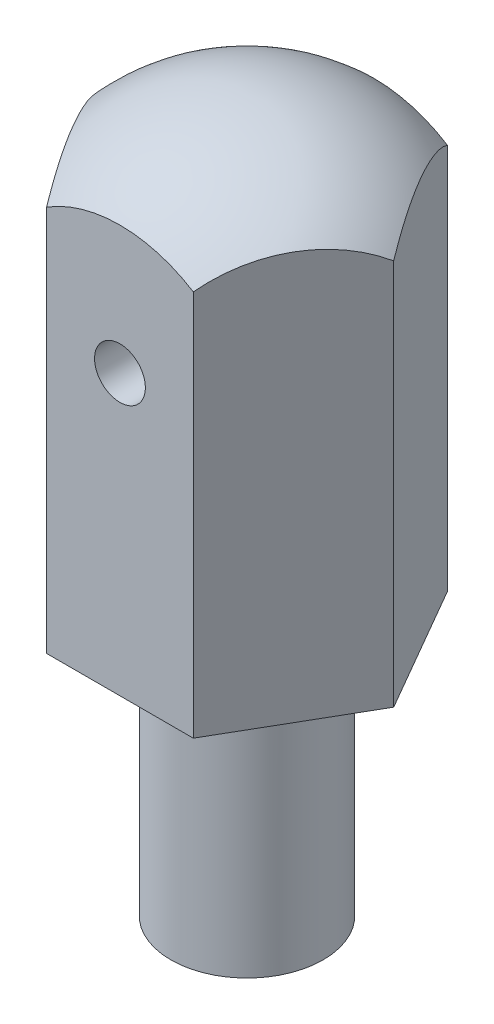
ISO-10303-21;
HEADER;
FILE_DESCRIPTION(('STEP AP214'),'2;1');
FILE_NAME('part.step','',(''),(''),'','','');
FILE_SCHEMA(('AUTOMOTIVE_DESIGN { 1 0 10303 214 1 1 1 1 }'));
ENDSEC;
DATA;
#1=APPLICATION_CONTEXT('core data for automotive mechanical design processes');
#2=APPLICATION_PROTOCOL_DEFINITION('international standard','automotive_design',2000,#1);
#3=PRODUCT_CONTEXT('',#1,'mechanical');
#4=PRODUCT('Part','Part','',(#3));
#5=PRODUCT_RELATED_PRODUCT_CATEGORY('part','',(#4));
#6=PRODUCT_DEFINITION_FORMATION('','',#4);
#7=PRODUCT_DEFINITION_CONTEXT('part definition',#1,'design');
#8=PRODUCT_DEFINITION('design','',#6,#7);
#9=PRODUCT_DEFINITION_SHAPE('','',#8);
#10=(LENGTH_UNIT() NAMED_UNIT(*) SI_UNIT(.MILLI.,.METRE.));
#11=(NAMED_UNIT(*) PLANE_ANGLE_UNIT() SI_UNIT($,.RADIAN.));
#12=(NAMED_UNIT(*) SI_UNIT($,.STERADIAN.) SOLID_ANGLE_UNIT());
#13=UNCERTAINTY_MEASURE_WITH_UNIT(LENGTH_MEASURE(1.E-05),#10,'distance_accuracy_value','');
#14=(GEOMETRIC_REPRESENTATION_CONTEXT(3) GLOBAL_UNCERTAINTY_ASSIGNED_CONTEXT((#13)) GLOBAL_UNIT_ASSIGNED_CONTEXT((#10,
#11,#12)) REPRESENTATION_CONTEXT('',''));
#15=CARTESIAN_POINT('',(0.,0.,0.));
#16=DIRECTION('',(0.,0.,1.));
#17=DIRECTION('',(1.,0.,0.));
#18=AXIS2_PLACEMENT_3D('',#15,#16,#17);
#19=CARTESIAN_POINT('',(2.88675134594812,0.,0.));
#20=DIRECTION('',(0.,1.,0.));
#21=DIRECTION('',(0.,0.,1.));
#22=AXIS2_PLACEMENT_3D('',#19,#20,#21);
#23=PLANE('',#22);
#24=DIRECTION('',(0.5,0.,-0.866025403784439));
#25=VECTOR('',#24,1.);
#26=CARTESIAN_POINT('',(1.44337567297405,0.,2.5));
#27=LINE('',#26,#25);
#28=CARTESIAN_POINT('',(1.44337567297405,0.,2.5));
#29=VERTEX_POINT('',#28);
#30=CARTESIAN_POINT('',(2.88675134594812,0.,0.));
#31=VERTEX_POINT('',#30);
#32=EDGE_CURVE('E77',#29,#31,#27,.T.);
#33=ORIENTED_EDGE('',*,*,#32,.F.);
#34=DIRECTION('',(1.,0.,0.));
#35=VECTOR('',#34,1.);
#36=CARTESIAN_POINT('',(-1.44337567297407,0.,2.5));
#37=LINE('',#36,#35);
#38=CARTESIAN_POINT('',(-1.44337567297407,0.,2.5));
#39=VERTEX_POINT('',#38);
#40=EDGE_CURVE('E99',#39,#29,#37,.T.);
#41=ORIENTED_EDGE('',*,*,#40,.F.);
#42=DIRECTION('',(0.5,0.,0.866025403784438));
#43=VECTOR('',#42,1.);
#44=CARTESIAN_POINT('',(-2.88675134594815,0.,0.));
#45=LINE('',#44,#43);
#46=CARTESIAN_POINT('',(-2.88675134594815,0.,0.));
#47=VERTEX_POINT('',#46);
#48=EDGE_CURVE('E101',#47,#39,#45,.T.);
#49=ORIENTED_EDGE('',*,*,#48,.F.);
#50=DIRECTION('',(-0.5,0.,0.866025403784438));
#51=VECTOR('',#50,1.);
#52=CARTESIAN_POINT('',(-1.44337567297407,0.,-2.5));
#53=LINE('',#52,#51);
#54=CARTESIAN_POINT('',(-1.44337567297407,0.,-2.5));
#55=VERTEX_POINT('',#54);
#56=EDGE_CURVE('E104',#55,#47,#53,.T.);
#57=ORIENTED_EDGE('',*,*,#56,.F.);
#58=DIRECTION('',(-1.,0.,0.));
#59=VECTOR('',#58,1.);
#60=CARTESIAN_POINT('',(1.44337567297404,0.,-2.5));
#61=LINE('',#60,#59);
#62=CARTESIAN_POINT('',(1.44337567297404,0.,-2.5));
#63=VERTEX_POINT('',#62);
#64=EDGE_CURVE('E107',#63,#55,#61,.T.);
#65=ORIENTED_EDGE('',*,*,#64,.F.);
#66=DIRECTION('',(-0.5,0.,-0.866025403784439));
#67=VECTOR('',#66,1.);
#68=CARTESIAN_POINT('',(2.88675134594812,0.,0.));
#69=LINE('',#68,#67);
#70=EDGE_CURVE('E110',#31,#63,#69,.T.);
#71=ORIENTED_EDGE('',*,*,#70,.F.);
#72=EDGE_LOOP('',(#33,#41,#49,#57,#65,#71));
#73=FACE_BOUND('',#72,.T.);
#74=CARTESIAN_POINT('',(0.,0.,0.));
#75=DIRECTION('',(0.,1.,0.));
#76=DIRECTION('',(0.,0.,1.));
#77=AXIS2_PLACEMENT_3D('',#74,#75,#76);
#78=CIRCLE('',#77,1.5);
#79=CARTESIAN_POINT('',(0.,0.,1.5));
#80=VERTEX_POINT('',#79);
#81=EDGE_CURVE('E11',#80,#80,#78,.F.);
#82=ORIENTED_EDGE('',*,*,#81,.F.);
#83=EDGE_LOOP('',(#82));
#84=FACE_BOUND('',#83,.T.);
#85=ADVANCED_FACE('F16',(#73,#84),#23,.F.);
#86=CARTESIAN_POINT('',(1.44337567297405,9.,2.5));
#87=DIRECTION('',(-0.866025403784439,0.,-0.5));
#88=DIRECTION('',(-0.5,0.,0.86602540378444));
#89=AXIS2_PLACEMENT_3D('',#86,#87,#88);
#90=PLANE('',#89);
#91=DIRECTION('',(0.,-1.,0.));
#92=VECTOR('',#91,1.);
#93=CARTESIAN_POINT('',(2.88675134594812,9.,0.));
#94=LINE('',#93,#92);
#95=CARTESIAN_POINT('',(2.88675134594812,7.60604160964115,0.));
#96=VERTEX_POINT('',#95);
#97=EDGE_CURVE('E83',#96,#31,#94,.T.);
#98=ORIENTED_EDGE('',*,*,#97,.F.);
#99=CARTESIAN_POINT('',(2.1650635094611,5.31393110495224,1.25));
#100=DIRECTION('',(-0.866025403784439,0.,-0.5));
#101=DIRECTION('',(-0.5,0.,0.86602540378444));
#102=AXIS2_PLACEMENT_3D('',#99,#100,#101);
#103=CIRCLE('',#102,2.70870889891081);
#104=CARTESIAN_POINT('',(1.44337567297402,7.60604160964115,2.5));
#105=VERTEX_POINT('',#104);
#106=EDGE_CURVE('E71',#96,#105,#103,.F.);
#107=ORIENTED_EDGE('',*,*,#106,.T.);
#108=DIRECTION('',(0.,-1.,0.));
#109=VECTOR('',#108,1.);
#110=CARTESIAN_POINT('',(1.44337567297405,9.,2.5));
#111=LINE('',#110,#109);
#112=EDGE_CURVE('E39',#105,#29,#111,.T.);
#113=ORIENTED_EDGE('',*,*,#112,.T.);
#114=ORIENTED_EDGE('',*,*,#32,.T.);
#115=EDGE_LOOP('',(#98,#107,#113,#114));
#116=FACE_BOUND('',#115,.T.);
#117=ADVANCED_FACE('F18',(#116),#90,.F.);
#118=CARTESIAN_POINT('',(2.88675134594812,9.,0.));
#119=DIRECTION('',(-0.866025403784439,0.,0.5));
#120=DIRECTION('',(0.5,0.,0.866025403784439));
#121=AXIS2_PLACEMENT_3D('',#118,#119,#120);
#122=PLANE('',#121);
#123=DIRECTION('',(0.,-1.,0.));
#124=VECTOR('',#123,1.);
#125=CARTESIAN_POINT('',(1.44337567297404,9.,-2.5));
#126=LINE('',#125,#124);
#127=CARTESIAN_POINT('',(1.44337567297401,7.60604160964115,-2.5));
#128=VERTEX_POINT('',#127);
#129=EDGE_CURVE('E85',#128,#63,#126,.T.);
#130=ORIENTED_EDGE('',*,*,#129,.F.);
#131=CARTESIAN_POINT('',(2.16506350946109,5.31393110495224,-1.25));
#132=DIRECTION('',(-0.866025403784439,0.,0.5));
#133=DIRECTION('',(0.5,0.,0.866025403784439));
#134=AXIS2_PLACEMENT_3D('',#131,#132,#133);
#135=CIRCLE('',#134,2.70870889891081);
#136=EDGE_CURVE('E74',#128,#96,#135,.F.);
#137=ORIENTED_EDGE('',*,*,#136,.T.);
#138=ORIENTED_EDGE('',*,*,#97,.T.);
#139=ORIENTED_EDGE('',*,*,#70,.T.);
#140=EDGE_LOOP('',(#130,#137,#138,#139));
#141=FACE_BOUND('',#140,.T.);
#142=ADVANCED_FACE('F81',(#141),#122,.F.);
#143=CARTESIAN_POINT('',(1.44337567297404,9.,-2.5));
#144=DIRECTION('',(0.,0.,1.));
#145=DIRECTION('',(1.,0.,0.));
#146=AXIS2_PLACEMENT_3D('',#143,#144,#145);
#147=PLANE('',#146);
#148=CARTESIAN_POINT('',(0.,5.5,-2.5));
#149=DIRECTION('',(0.,0.,1.));
#150=DIRECTION('',(1.,0.,0.));
#151=AXIS2_PLACEMENT_3D('',#148,#149,#150);
#152=CIRCLE('',#151,0.5);
#153=CARTESIAN_POINT('',(0.5,5.5,-2.5));
#154=VERTEX_POINT('',#153);
#155=EDGE_CURVE('E118',#154,#154,#152,.T.);
#156=ORIENTED_EDGE('',*,*,#155,.T.);
#157=EDGE_LOOP('',(#156));
#158=FACE_BOUND('',#157,.T.);
#159=DIRECTION('',(0.,-1.,0.));
#160=VECTOR('',#159,1.);
#161=CARTESIAN_POINT('',(-1.44337567297407,9.,-2.5));
#162=LINE('',#161,#160);
#163=CARTESIAN_POINT('',(-1.4433756729741,7.60604160964115,-2.5));
#164=VERTEX_POINT('',#163);
#165=EDGE_CURVE('E90',#164,#55,#162,.T.);
#166=ORIENTED_EDGE('',*,*,#165,.F.);
#167=CARTESIAN_POINT('',(0.,5.31393110495224,-2.5));
#168=DIRECTION('',(0.,0.,1.));
#169=DIRECTION('',(1.,0.,0.));
#170=AXIS2_PLACEMENT_3D('',#167,#168,#169);
#171=CIRCLE('',#170,2.70870889891078);
#172=EDGE_CURVE('E86',#164,#128,#171,.F.);
#173=ORIENTED_EDGE('',*,*,#172,.T.);
#174=ORIENTED_EDGE('',*,*,#129,.T.);
#175=ORIENTED_EDGE('',*,*,#64,.T.);
#176=EDGE_LOOP('',(#166,#173,#174,#175));
#177=FACE_BOUND('',#176,.T.);
#178=ADVANCED_FACE('F158',(#158,#177),#147,.F.);
#179=CARTESIAN_POINT('',(-1.44337567297407,9.,-2.5));
#180=DIRECTION('',(0.866025403784439,0.,0.5));
#181=DIRECTION('',(0.5,0.,-0.866025403784439));
#182=AXIS2_PLACEMENT_3D('',#179,#180,#181);
#183=PLANE('',#182);
#184=DIRECTION('',(0.,-1.,0.));
#185=VECTOR('',#184,1.);
#186=CARTESIAN_POINT('',(-2.88675134594815,9.,0.));
#187=LINE('',#186,#185);
#188=CARTESIAN_POINT('',(-2.88675134594813,7.60604160964115,0.));
#189=VERTEX_POINT('',#188);
#190=EDGE_CURVE('E94',#189,#47,#187,.T.);
#191=ORIENTED_EDGE('',*,*,#190,.F.);
#192=CARTESIAN_POINT('',(-2.16506350946112,5.31393110495224,-1.25));
#193=DIRECTION('',(0.866025403784439,0.,0.5));
#194=DIRECTION('',(0.5,0.,-0.866025403784439));
#195=AXIS2_PLACEMENT_3D('',#192,#193,#194);
#196=CIRCLE('',#195,2.70870889891079);
#197=EDGE_CURVE('E114',#189,#164,#196,.F.);
#198=ORIENTED_EDGE('',*,*,#197,.T.);
#199=ORIENTED_EDGE('',*,*,#165,.T.);
#200=ORIENTED_EDGE('',*,*,#56,.T.);
#201=EDGE_LOOP('',(#191,#198,#199,#200));
#202=FACE_BOUND('',#201,.T.);
#203=ADVANCED_FACE('F154',(#202),#183,.F.);
#204=CARTESIAN_POINT('',(-2.88675134594815,9.,0.));
#205=DIRECTION('',(0.866025403784438,0.,-0.5));
#206=DIRECTION('',(-0.5,0.,-0.866025403784438));
#207=AXIS2_PLACEMENT_3D('',#204,#205,#206);
#208=PLANE('',#207);
#209=DIRECTION('',(0.,-1.,0.));
#210=VECTOR('',#209,1.);
#211=CARTESIAN_POINT('',(-1.44337567297407,9.,2.5));
#212=LINE('',#211,#210);
#213=CARTESIAN_POINT('',(-1.44337567297407,7.60604160964115,2.5));
#214=VERTEX_POINT('',#213);
#215=EDGE_CURVE('E96',#214,#39,#212,.T.);
#216=ORIENTED_EDGE('',*,*,#215,.F.);
#217=CARTESIAN_POINT('',(-2.16506350946111,5.31393110495224,1.25));
#218=DIRECTION('',(0.866025403784438,0.,-0.5));
#219=DIRECTION('',(-0.5,0.,-0.866025403784438));
#220=AXIS2_PLACEMENT_3D('',#217,#218,#219);
#221=CIRCLE('',#220,2.7087088989108);
#222=EDGE_CURVE('E31',#214,#189,#221,.F.);
#223=ORIENTED_EDGE('',*,*,#222,.T.);
#224=ORIENTED_EDGE('',*,*,#190,.T.);
#225=ORIENTED_EDGE('',*,*,#48,.T.);
#226=EDGE_LOOP('',(#216,#223,#224,#225));
#227=FACE_BOUND('',#226,.T.);
#228=ADVANCED_FACE('F150',(#227),#208,.F.);
#229=CARTESIAN_POINT('',(-1.44337567297407,9.,2.5));
#230=DIRECTION('',(0.,0.,-1.));
#231=DIRECTION('',(-1.,0.,0.));
#232=AXIS2_PLACEMENT_3D('',#229,#230,#231);
#233=PLANE('',#232);
#234=CARTESIAN_POINT('',(0.,5.5,2.5));
#235=DIRECTION('',(0.,0.,1.));
#236=DIRECTION('',(1.,0.,0.));
#237=AXIS2_PLACEMENT_3D('',#234,#235,#236);
#238=CIRCLE('',#237,0.5);
#239=CARTESIAN_POINT('',(0.5,5.5,2.5));
#240=VERTEX_POINT('',#239);
#241=EDGE_CURVE('E119',#240,#240,#238,.T.);
#242=ORIENTED_EDGE('',*,*,#241,.F.);
#243=EDGE_LOOP('',(#242));
#244=FACE_BOUND('',#243,.T.);
#245=ORIENTED_EDGE('',*,*,#112,.F.);
#246=CARTESIAN_POINT('',(0.,5.31393110495224,2.5));
#247=DIRECTION('',(0.,0.,-1.));
#248=DIRECTION('',(-1.,0.,0.));
#249=AXIS2_PLACEMENT_3D('',#246,#247,#248);
#250=CIRCLE('',#249,2.70870889891079);
#251=EDGE_CURVE('E24',#105,#214,#250,.F.);
#252=ORIENTED_EDGE('',*,*,#251,.T.);
#253=ORIENTED_EDGE('',*,*,#215,.T.);
#254=ORIENTED_EDGE('',*,*,#40,.T.);
#255=EDGE_LOOP('',(#245,#252,#253,#254));
#256=FACE_BOUND('',#255,.T.);
#257=ADVANCED_FACE('F147',(#244,#256),#233,.F.);
#258=CARTESIAN_POINT('',(0.,5.31393110495224,0.));
#259=DIRECTION('',(0.,-1.,0.));
#260=DIRECTION('',(1.,0.,0.));
#261=AXIS2_PLACEMENT_3D('',#258,#259,#260);
#262=SPHERICAL_SURFACE('',#261,3.68606889504776);
#263=CARTESIAN_POINT('',(0.,9.,0.));
#264=VERTEX_POINT('',#263);
#265=VERTEX_LOOP('',#264);
#266=FACE_BOUND('',#265,.T.);
#267=ORIENTED_EDGE('',*,*,#136,.F.);
#268=ORIENTED_EDGE('',*,*,#172,.F.);
#269=ORIENTED_EDGE('',*,*,#197,.F.);
#270=ORIENTED_EDGE('',*,*,#222,.F.);
#271=ORIENTED_EDGE('',*,*,#251,.F.);
#272=ORIENTED_EDGE('',*,*,#106,.F.);
#273=EDGE_LOOP('',(#267,#268,#269,#270,#271,#272));
#274=FACE_BOUND('',#273,.T.);
#275=ADVANCED_FACE('F73',(#266,#274),#262,.T.);
#276=CARTESIAN_POINT('',(0.,5.5,-2.5));
#277=DIRECTION('',(0.,0.,1.));
#278=DIRECTION('',(1.,0.,0.));
#279=AXIS2_PLACEMENT_3D('',#276,#277,#278);
#280=CYLINDRICAL_SURFACE('',#279,0.5);
#281=ORIENTED_EDGE('',*,*,#155,.F.);
#282=EDGE_LOOP('',(#281));
#283=FACE_BOUND('',#282,.T.);
#284=ORIENTED_EDGE('',*,*,#241,.T.);
#285=EDGE_LOOP('',(#284));
#286=FACE_BOUND('',#285,.T.);
#287=ADVANCED_FACE('F133',(#283,#286),#280,.F.);
#288=CARTESIAN_POINT('',(0.,-5.,0.));
#289=DIRECTION('',(0.,1.,0.));
#290=DIRECTION('',(0.,0.,1.));
#291=AXIS2_PLACEMENT_3D('',#288,#289,#290);
#292=CYLINDRICAL_SURFACE('',#291,1.5);
#293=CARTESIAN_POINT('',(0.,-5.,0.));
#294=DIRECTION('',(0.,-1.,0.));
#295=DIRECTION('',(0.,0.,-1.));
#296=AXIS2_PLACEMENT_3D('',#293,#294,#295);
#297=CIRCLE('',#296,1.5);
#298=CARTESIAN_POINT('',(0.,-5.,-1.5));
#299=VERTEX_POINT('',#298);
#300=EDGE_CURVE('E122',#299,#299,#297,.T.);
#301=ORIENTED_EDGE('',*,*,#300,.F.);
#302=EDGE_LOOP('',(#301));
#303=FACE_BOUND('',#302,.T.);
#304=ORIENTED_EDGE('',*,*,#81,.T.);
#305=EDGE_LOOP('',(#304));
#306=FACE_BOUND('',#305,.T.);
#307=ADVANCED_FACE('F130',(#303,#306),#292,.T.);
#308=CARTESIAN_POINT('',(0.,-5.,0.));
#309=DIRECTION('',(0.,-1.,0.));
#310=DIRECTION('',(0.,0.,-1.));
#311=AXIS2_PLACEMENT_3D('',#308,#309,#310);
#312=PLANE('',#311);
#313=ORIENTED_EDGE('',*,*,#300,.T.);
#314=EDGE_LOOP('',(#313));
#315=FACE_BOUND('',#314,.T.);
#316=ADVANCED_FACE('F128',(#315),#312,.T.);
#317=CLOSED_SHELL('',(#85,#117,#142,#178,#203,#228,#257,#275,#287,#307,#316));
#318=MANIFOLD_SOLID_BREP('B1',#317);
#319=ADVANCED_BREP_SHAPE_REPRESENTATION('',(#18,#318),#14);
#320=SHAPE_DEFINITION_REPRESENTATION(#9,#319);
ENDSEC;
END-ISO-10303-21;
